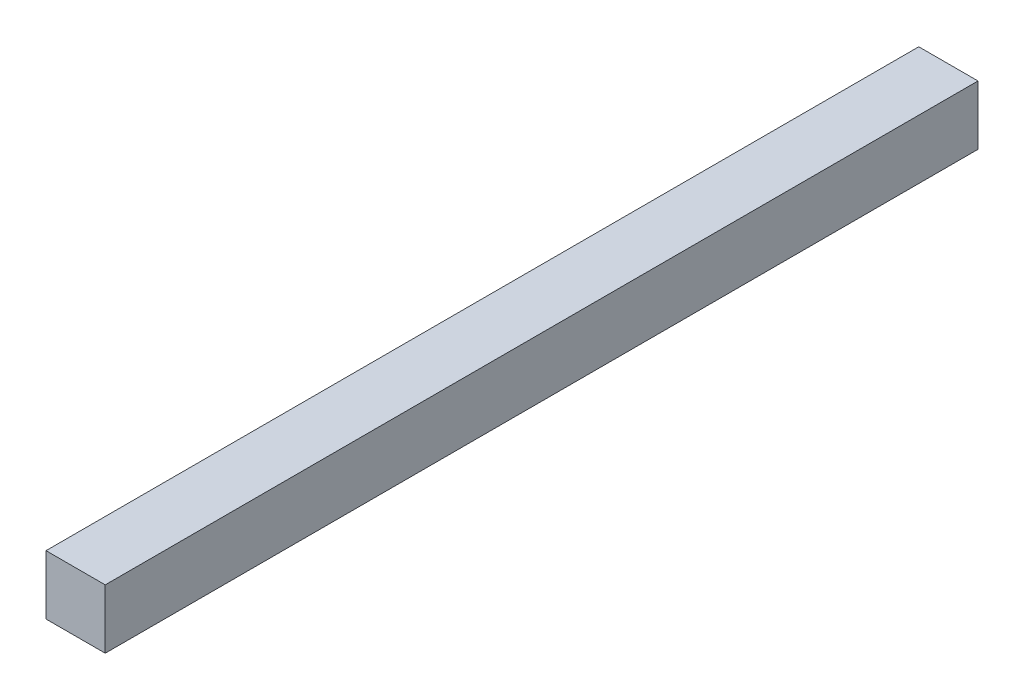
ISO-10303-21;
HEADER;
FILE_DESCRIPTION(('STEP AP214'),'2;1');
FILE_NAME('part.step','',(''),(''),'','','');
FILE_SCHEMA(('AUTOMOTIVE_DESIGN { 1 0 10303 214 1 1 1 1 }'));
ENDSEC;
DATA;
#1=APPLICATION_CONTEXT('core data for automotive mechanical design processes');
#2=APPLICATION_PROTOCOL_DEFINITION('international standard','automotive_design',2000,#1);
#3=PRODUCT_CONTEXT('',#1,'mechanical');
#4=PRODUCT('Part','Part','',(#3));
#5=PRODUCT_RELATED_PRODUCT_CATEGORY('part','',(#4));
#6=PRODUCT_DEFINITION_FORMATION('','',#4);
#7=PRODUCT_DEFINITION_CONTEXT('part definition',#1,'design');
#8=PRODUCT_DEFINITION('design','',#6,#7);
#9=PRODUCT_DEFINITION_SHAPE('','',#8);
#10=(LENGTH_UNIT() NAMED_UNIT(*) SI_UNIT(.MILLI.,.METRE.));
#11=(NAMED_UNIT(*) PLANE_ANGLE_UNIT() SI_UNIT($,.RADIAN.));
#12=(NAMED_UNIT(*) SI_UNIT($,.STERADIAN.) SOLID_ANGLE_UNIT());
#13=UNCERTAINTY_MEASURE_WITH_UNIT(LENGTH_MEASURE(1.E-05),#10,'distance_accuracy_value','');
#14=(GEOMETRIC_REPRESENTATION_CONTEXT(3) GLOBAL_UNCERTAINTY_ASSIGNED_CONTEXT((#13)) GLOBAL_UNIT_ASSIGNED_CONTEXT((#10,
#11,#12)) REPRESENTATION_CONTEXT('',''));
#15=CARTESIAN_POINT('',(0.,0.,0.));
#16=DIRECTION('',(0.,0.,1.));
#17=DIRECTION('',(1.,0.,0.));
#18=AXIS2_PLACEMENT_3D('',#15,#16,#17);
#19=CARTESIAN_POINT('',(0.3494913,-0.3494913,0.));
#20=DIRECTION('',(-1.,0.,0.));
#21=DIRECTION('',(0.,0.,1.));
#22=AXIS2_PLACEMENT_3D('',#19,#20,#21);
#23=PLANE('',#22);
#24=DIRECTION('',(0.,0.,-1.));
#25=VECTOR('',#24,1.);
#26=CARTESIAN_POINT('',(0.3494913,0.34949384,0.));
#27=LINE('',#26,#25);
#28=CARTESIAN_POINT('',(0.3494913,0.34949384,0.));
#29=VERTEX_POINT('',#28);
#30=CARTESIAN_POINT('',(0.3494913,0.34949384,10.3));
#31=VERTEX_POINT('',#30);
#32=EDGE_CURVE('E58',#29,#31,#27,.F.);
#33=ORIENTED_EDGE('',*,*,#32,.T.);
#34=DIRECTION('',(0.,1.,0.));
#35=VECTOR('',#34,1.);
#36=CARTESIAN_POINT('',(0.3494913,0.34949384,10.3));
#37=LINE('',#36,#35);
#38=CARTESIAN_POINT('',(0.3494913,-0.3494913,10.3));
#39=VERTEX_POINT('',#38);
#40=EDGE_CURVE('E55',#31,#39,#37,.F.);
#41=ORIENTED_EDGE('',*,*,#40,.T.);
#42=DIRECTION('',(0.,0.,1.));
#43=VECTOR('',#42,1.);
#44=CARTESIAN_POINT('',(0.3494913,-0.3494913,0.));
#45=LINE('',#44,#43);
#46=CARTESIAN_POINT('',(0.3494913,-0.3494913,0.));
#47=VERTEX_POINT('',#46);
#48=EDGE_CURVE('E77',#39,#47,#45,.F.);
#49=ORIENTED_EDGE('',*,*,#48,.T.);
#50=DIRECTION('',(0.,1.,0.));
#51=VECTOR('',#50,1.);
#52=CARTESIAN_POINT('',(0.3494913,-0.3494913,0.));
#53=LINE('',#52,#51);
#54=EDGE_CURVE('E20',#29,#47,#53,.F.);
#55=ORIENTED_EDGE('',*,*,#54,.F.);
#56=EDGE_LOOP('',(#33,#41,#49,#55));
#57=FACE_BOUND('',#56,.T.);
#58=ADVANCED_FACE('F17',(#57),#23,.F.);
#59=CARTESIAN_POINT('',(0.3494913,0.34949384,0.));
#60=DIRECTION('',(0.,-1.,0.));
#61=DIRECTION('',(0.,0.,-1.));
#62=AXIS2_PLACEMENT_3D('',#59,#60,#61);
#63=PLANE('',#62);
#64=DIRECTION('',(0.,0.,-1.));
#65=VECTOR('',#64,1.);
#66=CARTESIAN_POINT('',(-0.3494913,0.34949384,0.));
#67=LINE('',#66,#65);
#68=CARTESIAN_POINT('',(-0.3494913,0.34949384,0.));
#69=VERTEX_POINT('',#68);
#70=CARTESIAN_POINT('',(-0.3494913,0.34949384,10.3));
#71=VERTEX_POINT('',#70);
#72=EDGE_CURVE('E73',#69,#71,#67,.F.);
#73=ORIENTED_EDGE('',*,*,#72,.T.);
#74=DIRECTION('',(-1.,0.,0.));
#75=VECTOR('',#74,1.);
#76=CARTESIAN_POINT('',(-0.3494913,0.34949384,10.3));
#77=LINE('',#76,#75);
#78=EDGE_CURVE('E63',#71,#31,#77,.F.);
#79=ORIENTED_EDGE('',*,*,#78,.T.);
#80=ORIENTED_EDGE('',*,*,#32,.F.);
#81=DIRECTION('',(-1.,0.,0.));
#82=VECTOR('',#81,1.);
#83=CARTESIAN_POINT('',(-0.3494913,0.34949384,0.));
#84=LINE('',#83,#82);
#85=EDGE_CURVE('E79',#69,#29,#84,.F.);
#86=ORIENTED_EDGE('',*,*,#85,.F.);
#87=EDGE_LOOP('',(#73,#79,#80,#86));
#88=FACE_BOUND('',#87,.T.);
#89=ADVANCED_FACE('F72',(#88),#63,.F.);
#90=CARTESIAN_POINT('',(-0.3494913,0.34949384,10.3));
#91=DIRECTION('',(0.,0.,-1.));
#92=DIRECTION('',(-1.,0.,0.));
#93=AXIS2_PLACEMENT_3D('',#90,#91,#92);
#94=PLANE('',#93);
#95=DIRECTION('',(1.,0.,0.));
#96=VECTOR('',#95,1.);
#97=CARTESIAN_POINT('',(-0.3494913,-0.3494913,10.3));
#98=LINE('',#97,#96);
#99=CARTESIAN_POINT('',(-0.3494913,-0.3494913,10.3));
#100=VERTEX_POINT('',#99);
#101=EDGE_CURVE('E69',#100,#39,#98,.T.);
#102=ORIENTED_EDGE('',*,*,#101,.T.);
#103=ORIENTED_EDGE('',*,*,#40,.F.);
#104=ORIENTED_EDGE('',*,*,#78,.F.);
#105=DIRECTION('',(0.,1.,0.));
#106=VECTOR('',#105,1.);
#107=CARTESIAN_POINT('',(-0.3494913,0.34949384,10.3));
#108=LINE('',#107,#106);
#109=EDGE_CURVE('E83',#71,#100,#108,.F.);
#110=ORIENTED_EDGE('',*,*,#109,.T.);
#111=EDGE_LOOP('',(#102,#103,#104,#110));
#112=FACE_BOUND('',#111,.T.);
#113=ADVANCED_FACE('F66',(#112),#94,.F.);
#114=CARTESIAN_POINT('',(-0.3494913,-0.3494913,0.));
#115=DIRECTION('',(0.,1.,0.));
#116=DIRECTION('',(0.,0.,1.));
#117=AXIS2_PLACEMENT_3D('',#114,#115,#116);
#118=PLANE('',#117);
#119=ORIENTED_EDGE('',*,*,#48,.F.);
#120=ORIENTED_EDGE('',*,*,#101,.F.);
#121=DIRECTION('',(0.,0.,-1.));
#122=VECTOR('',#121,1.);
#123=CARTESIAN_POINT('',(-0.3494913,-0.3494913,0.));
#124=LINE('',#123,#122);
#125=CARTESIAN_POINT('',(-0.3494913,-0.3494913,0.));
#126=VERTEX_POINT('',#125);
#127=EDGE_CURVE('E26',#100,#126,#124,.T.);
#128=ORIENTED_EDGE('',*,*,#127,.T.);
#129=DIRECTION('',(-1.,0.,0.));
#130=VECTOR('',#129,1.);
#131=CARTESIAN_POINT('',(-0.3494913,-0.3494913,0.));
#132=LINE('',#131,#130);
#133=EDGE_CURVE('E34',#47,#126,#132,.T.);
#134=ORIENTED_EDGE('',*,*,#133,.F.);
#135=EDGE_LOOP('',(#119,#120,#128,#134));
#136=FACE_BOUND('',#135,.T.);
#137=ADVANCED_FACE('F88',(#136),#118,.F.);
#138=CARTESIAN_POINT('',(-0.3494913,0.34949384,0.));
#139=DIRECTION('',(0.,0.,-1.));
#140=DIRECTION('',(-1.,0.,0.));
#141=AXIS2_PLACEMENT_3D('',#138,#139,#140);
#142=PLANE('',#141);
#143=ORIENTED_EDGE('',*,*,#133,.T.);
#144=DIRECTION('',(0.,1.,0.));
#145=VECTOR('',#144,1.);
#146=CARTESIAN_POINT('',(-0.3494913,0.34949384,0.));
#147=LINE('',#146,#145);
#148=EDGE_CURVE('E11',#126,#69,#147,.T.);
#149=ORIENTED_EDGE('',*,*,#148,.T.);
#150=ORIENTED_EDGE('',*,*,#85,.T.);
#151=ORIENTED_EDGE('',*,*,#54,.T.);
#152=EDGE_LOOP('',(#143,#149,#150,#151));
#153=FACE_BOUND('',#152,.T.);
#154=ADVANCED_FACE('F91',(#153),#142,.T.);
#155=CARTESIAN_POINT('',(-0.3494913,0.34949384,0.));
#156=DIRECTION('',(1.,0.,0.));
#157=DIRECTION('',(0.,0.,-1.));
#158=AXIS2_PLACEMENT_3D('',#155,#156,#157);
#159=PLANE('',#158);
#160=ORIENTED_EDGE('',*,*,#127,.F.);
#161=ORIENTED_EDGE('',*,*,#109,.F.);
#162=ORIENTED_EDGE('',*,*,#72,.F.);
#163=ORIENTED_EDGE('',*,*,#148,.F.);
#164=EDGE_LOOP('',(#160,#161,#162,#163));
#165=FACE_BOUND('',#164,.T.);
#166=ADVANCED_FACE('F90',(#165),#159,.F.);
#167=CLOSED_SHELL('',(#58,#89,#113,#137,#154,#166));
#168=MANIFOLD_SOLID_BREP('B1',#167);
#169=ADVANCED_BREP_SHAPE_REPRESENTATION('',(#18,#168),#14);
#170=SHAPE_DEFINITION_REPRESENTATION(#9,#169);
ENDSEC;
END-ISO-10303-21;
